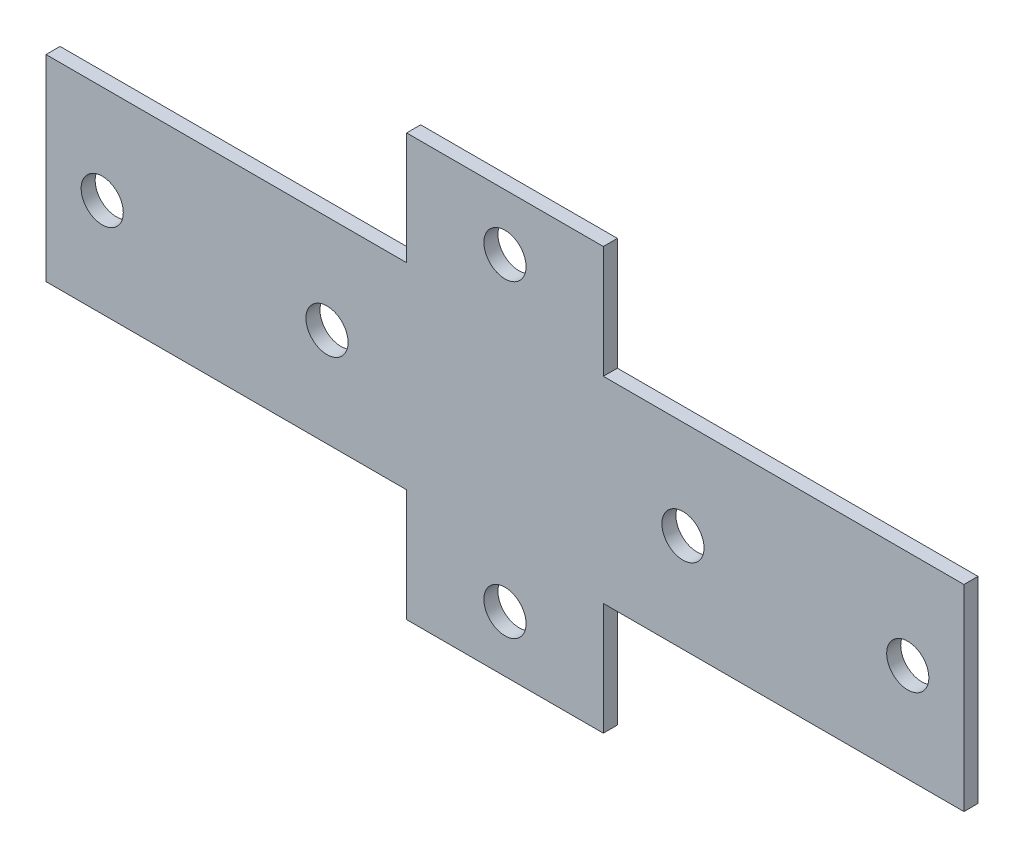
ISO-10303-21;
HEADER;
FILE_DESCRIPTION(('STEP AP214'),'2;1');
FILE_NAME('part.step','',(''),(''),'','','');
FILE_SCHEMA(('AUTOMOTIVE_DESIGN { 1 0 10303 214 1 1 1 1 }'));
ENDSEC;
DATA;
#1=APPLICATION_CONTEXT('core data for automotive mechanical design processes');
#2=APPLICATION_PROTOCOL_DEFINITION('international standard','automotive_design',2000,#1);
#3=PRODUCT_CONTEXT('',#1,'mechanical');
#4=PRODUCT('Part','Part','',(#3));
#5=PRODUCT_RELATED_PRODUCT_CATEGORY('part','',(#4));
#6=PRODUCT_DEFINITION_FORMATION('','',#4);
#7=PRODUCT_DEFINITION_CONTEXT('part definition',#1,'design');
#8=PRODUCT_DEFINITION('design','',#6,#7);
#9=PRODUCT_DEFINITION_SHAPE('','',#8);
#10=(LENGTH_UNIT() NAMED_UNIT(*) SI_UNIT(.MILLI.,.METRE.));
#11=(NAMED_UNIT(*) PLANE_ANGLE_UNIT() SI_UNIT($,.RADIAN.));
#12=(NAMED_UNIT(*) SI_UNIT($,.STERADIAN.) SOLID_ANGLE_UNIT());
#13=UNCERTAINTY_MEASURE_WITH_UNIT(LENGTH_MEASURE(1.E-05),#10,'distance_accuracy_value','');
#14=(GEOMETRIC_REPRESENTATION_CONTEXT(3) GLOBAL_UNCERTAINTY_ASSIGNED_CONTEXT((#13)) GLOBAL_UNIT_ASSIGNED_CONTEXT((#10,
#11,#12)) REPRESENTATION_CONTEXT('',''));
#15=CARTESIAN_POINT('',(0.,0.,0.));
#16=DIRECTION('',(0.,0.,1.));
#17=DIRECTION('',(1.,0.,0.));
#18=AXIS2_PLACEMENT_3D('',#15,#16,#17);
#19=CARTESIAN_POINT('',(0.,0.,3.));
#20=DIRECTION('',(0.,0.,1.));
#21=DIRECTION('',(1.,0.,0.));
#22=AXIS2_PLACEMENT_3D('',#19,#20,#21);
#23=PLANE('',#22);
#24=CARTESIAN_POINT('',(37.9999999999999,0.,3.));
#25=DIRECTION('',(0.,0.,1.));
#26=DIRECTION('',(-1.,0.,0.));
#27=AXIS2_PLACEMENT_3D('',#24,#25,#26);
#28=CIRCLE('',#27,4.5);
#29=CARTESIAN_POINT('',(33.4999999999999,0.,3.));
#30=VERTEX_POINT('',#29);
#31=EDGE_CURVE('E300',#30,#30,#28,.T.);
#32=ORIENTED_EDGE('',*,*,#31,.F.);
#33=EDGE_LOOP('',(#32));
#34=FACE_BOUND('',#33,.T.);
#35=CARTESIAN_POINT('',(-85.9999999999999,0.,3.));
#36=DIRECTION('',(0.,0.,1.));
#37=DIRECTION('',(1.,0.,0.));
#38=AXIS2_PLACEMENT_3D('',#35,#36,#37);
#39=CIRCLE('',#38,4.5);
#40=CARTESIAN_POINT('',(-81.4999999999998,0.,3.));
#41=VERTEX_POINT('',#40);
#42=EDGE_CURVE('E312',#41,#41,#39,.T.);
#43=ORIENTED_EDGE('',*,*,#42,.F.);
#44=EDGE_LOOP('',(#43));
#45=FACE_BOUND('',#44,.T.);
#46=CARTESIAN_POINT('',(0.,-33.,3.));
#47=DIRECTION('',(0.,0.,1.));
#48=DIRECTION('',(1.,0.,0.));
#49=AXIS2_PLACEMENT_3D('',#46,#47,#48);
#50=CIRCLE('',#49,4.5);
#51=CARTESIAN_POINT('',(4.5,-33.,3.));
#52=VERTEX_POINT('',#51);
#53=EDGE_CURVE('E159',#52,#52,#50,.T.);
#54=ORIENTED_EDGE('',*,*,#53,.F.);
#55=EDGE_LOOP('',(#54));
#56=FACE_BOUND('',#55,.T.);
#57=DIRECTION('',(0.,1.,0.));
#58=VECTOR('',#57,1.);
#59=CARTESIAN_POINT('',(98.0000000000001,21.,3.));
#60=LINE('',#59,#58);
#61=CARTESIAN_POINT('',(98.0000000000001,-21.,3.));
#62=VERTEX_POINT('',#61);
#63=CARTESIAN_POINT('',(98.0000000000001,21.,3.));
#64=VERTEX_POINT('',#63);
#65=EDGE_CURVE('E178',#62,#64,#60,.T.);
#66=ORIENTED_EDGE('',*,*,#65,.T.);
#67=DIRECTION('',(-1.,0.,0.));
#68=VECTOR('',#67,1.);
#69=CARTESIAN_POINT('',(21.,21.,3.));
#70=LINE('',#69,#68);
#71=CARTESIAN_POINT('',(21.,21.,3.));
#72=VERTEX_POINT('',#71);
#73=EDGE_CURVE('E106',#64,#72,#70,.T.);
#74=ORIENTED_EDGE('',*,*,#73,.T.);
#75=DIRECTION('',(0.,1.,0.));
#76=VECTOR('',#75,1.);
#77=CARTESIAN_POINT('',(21.,21.,3.));
#78=LINE('',#77,#76);
#79=CARTESIAN_POINT('',(21.,45.,3.));
#80=VERTEX_POINT('',#79);
#81=EDGE_CURVE('E205',#72,#80,#78,.T.);
#82=ORIENTED_EDGE('',*,*,#81,.T.);
#83=DIRECTION('',(-1.,0.,0.));
#84=VECTOR('',#83,1.);
#85=CARTESIAN_POINT('',(-21.,45.,3.));
#86=LINE('',#85,#84);
#87=CARTESIAN_POINT('',(-21.,45.,3.));
#88=VERTEX_POINT('',#87);
#89=EDGE_CURVE('E224',#80,#88,#86,.T.);
#90=ORIENTED_EDGE('',*,*,#89,.T.);
#91=DIRECTION('',(0.,-1.,0.));
#92=VECTOR('',#91,1.);
#93=CARTESIAN_POINT('',(-21.,21.,3.));
#94=LINE('',#93,#92);
#95=CARTESIAN_POINT('',(-21.,21.,3.));
#96=VERTEX_POINT('',#95);
#97=EDGE_CURVE('E221',#88,#96,#94,.T.);
#98=ORIENTED_EDGE('',*,*,#97,.T.);
#99=DIRECTION('',(-1.,0.,0.));
#100=VECTOR('',#99,1.);
#101=CARTESIAN_POINT('',(-97.9999999999999,21.,3.));
#102=LINE('',#101,#100);
#103=CARTESIAN_POINT('',(-97.9999999999999,21.,3.));
#104=VERTEX_POINT('',#103);
#105=EDGE_CURVE('E223',#96,#104,#102,.T.);
#106=ORIENTED_EDGE('',*,*,#105,.T.);
#107=DIRECTION('',(0.,-1.,0.));
#108=VECTOR('',#107,1.);
#109=CARTESIAN_POINT('',(-97.9999999999999,21.,3.));
#110=LINE('',#109,#108);
#111=CARTESIAN_POINT('',(-97.9999999999999,-21.,3.));
#112=VERTEX_POINT('',#111);
#113=EDGE_CURVE('E226',#104,#112,#110,.T.);
#114=ORIENTED_EDGE('',*,*,#113,.T.);
#115=DIRECTION('',(1.,0.,0.));
#116=VECTOR('',#115,1.);
#117=CARTESIAN_POINT('',(-97.9999999999999,-21.,3.));
#118=LINE('',#117,#116);
#119=CARTESIAN_POINT('',(-21.,-21.,3.));
#120=VERTEX_POINT('',#119);
#121=EDGE_CURVE('E232',#112,#120,#118,.T.);
#122=ORIENTED_EDGE('',*,*,#121,.T.);
#123=DIRECTION('',(0.,-1.,0.));
#124=VECTOR('',#123,1.);
#125=CARTESIAN_POINT('',(-21.,-45.,3.));
#126=LINE('',#125,#124);
#127=CARTESIAN_POINT('',(-21.,-45.,3.));
#128=VERTEX_POINT('',#127);
#129=EDGE_CURVE('E137',#120,#128,#126,.T.);
#130=ORIENTED_EDGE('',*,*,#129,.T.);
#131=DIRECTION('',(1.,0.,0.));
#132=VECTOR('',#131,1.);
#133=CARTESIAN_POINT('',(-21.,-45.,3.));
#134=LINE('',#133,#132);
#135=CARTESIAN_POINT('',(21.,-45.,3.));
#136=VERTEX_POINT('',#135);
#137=EDGE_CURVE('E131',#128,#136,#134,.T.);
#138=ORIENTED_EDGE('',*,*,#137,.T.);
#139=DIRECTION('',(0.,1.,0.));
#140=VECTOR('',#139,1.);
#141=CARTESIAN_POINT('',(21.,-45.,3.));
#142=LINE('',#141,#140);
#143=CARTESIAN_POINT('',(21.,-21.,3.));
#144=VERTEX_POINT('',#143);
#145=EDGE_CURVE('E135',#136,#144,#142,.T.);
#146=ORIENTED_EDGE('',*,*,#145,.T.);
#147=DIRECTION('',(1.,0.,0.));
#148=VECTOR('',#147,1.);
#149=CARTESIAN_POINT('',(21.,-21.,3.));
#150=LINE('',#149,#148);
#151=EDGE_CURVE('E51',#144,#62,#150,.T.);
#152=ORIENTED_EDGE('',*,*,#151,.T.);
#153=EDGE_LOOP('',(#66,#74,#82,#90,#98,#106,#114,#122,#130,#138,#146,#152));
#154=FACE_BOUND('',#153,.T.);
#155=CARTESIAN_POINT('',(0.,33.,3.));
#156=DIRECTION('',(0.,0.,1.));
#157=DIRECTION('',(1.,0.,0.));
#158=AXIS2_PLACEMENT_3D('',#155,#156,#157);
#159=CIRCLE('',#158,4.5);
#160=CARTESIAN_POINT('',(4.5,33.,3.));
#161=VERTEX_POINT('',#160);
#162=EDGE_CURVE('E318',#161,#161,#159,.T.);
#163=ORIENTED_EDGE('',*,*,#162,.F.);
#164=EDGE_LOOP('',(#163));
#165=FACE_BOUND('',#164,.T.);
#166=CARTESIAN_POINT('',(-37.9999999999999,0.,3.));
#167=DIRECTION('',(0.,0.,1.));
#168=DIRECTION('',(1.,0.,0.));
#169=AXIS2_PLACEMENT_3D('',#166,#167,#168);
#170=CIRCLE('',#169,4.5);
#171=CARTESIAN_POINT('',(-33.4999999999999,0.,3.));
#172=VERTEX_POINT('',#171);
#173=EDGE_CURVE('E306',#172,#172,#170,.T.);
#174=ORIENTED_EDGE('',*,*,#173,.F.);
#175=EDGE_LOOP('',(#174));
#176=FACE_BOUND('',#175,.T.);
#177=CARTESIAN_POINT('',(85.9999999999999,0.,3.));
#178=DIRECTION('',(0.,0.,1.));
#179=DIRECTION('',(-1.,0.,0.));
#180=AXIS2_PLACEMENT_3D('',#177,#178,#179);
#181=CIRCLE('',#180,4.5);
#182=CARTESIAN_POINT('',(81.4999999999998,0.,3.));
#183=VERTEX_POINT('',#182);
#184=EDGE_CURVE('E291',#183,#183,#181,.T.);
#185=ORIENTED_EDGE('',*,*,#184,.F.);
#186=EDGE_LOOP('',(#185));
#187=FACE_BOUND('',#186,.T.);
#188=ADVANCED_FACE('F34',(#34,#45,#56,#154,#165,#176,#187),#23,.T.);
#189=CARTESIAN_POINT('',(0.,0.,0.));
#190=DIRECTION('',(0.,0.,1.));
#191=DIRECTION('',(1.,0.,0.));
#192=AXIS2_PLACEMENT_3D('',#189,#190,#191);
#193=PLANE('',#192);
#194=DIRECTION('',(0.,1.,0.));
#195=VECTOR('',#194,1.);
#196=CARTESIAN_POINT('',(98.0000000000001,21.,0.));
#197=LINE('',#196,#195);
#198=CARTESIAN_POINT('',(98.0000000000001,-21.,0.));
#199=VERTEX_POINT('',#198);
#200=CARTESIAN_POINT('',(98.0000000000001,21.,0.));
#201=VERTEX_POINT('',#200);
#202=EDGE_CURVE('E155',#199,#201,#197,.T.);
#203=ORIENTED_EDGE('',*,*,#202,.F.);
#204=DIRECTION('',(1.,0.,0.));
#205=VECTOR('',#204,1.);
#206=CARTESIAN_POINT('',(21.,-21.,0.));
#207=LINE('',#206,#205);
#208=CARTESIAN_POINT('',(21.,-21.,0.));
#209=VERTEX_POINT('',#208);
#210=EDGE_CURVE('E98',#209,#199,#207,.T.);
#211=ORIENTED_EDGE('',*,*,#210,.F.);
#212=DIRECTION('',(0.,1.,0.));
#213=VECTOR('',#212,1.);
#214=CARTESIAN_POINT('',(21.,-45.,0.));
#215=LINE('',#214,#213);
#216=CARTESIAN_POINT('',(21.,-45.,0.));
#217=VERTEX_POINT('',#216);
#218=EDGE_CURVE('E92',#217,#209,#215,.T.);
#219=ORIENTED_EDGE('',*,*,#218,.F.);
#220=DIRECTION('',(1.,0.,0.));
#221=VECTOR('',#220,1.);
#222=CARTESIAN_POINT('',(-21.,-45.,0.));
#223=LINE('',#222,#221);
#224=CARTESIAN_POINT('',(-21.,-45.,0.));
#225=VERTEX_POINT('',#224);
#226=EDGE_CURVE('E145',#225,#217,#223,.T.);
#227=ORIENTED_EDGE('',*,*,#226,.F.);
#228=DIRECTION('',(0.,-1.,0.));
#229=VECTOR('',#228,1.);
#230=CARTESIAN_POINT('',(-21.,-45.,0.));
#231=LINE('',#230,#229);
#232=CARTESIAN_POINT('',(-21.,-21.,0.));
#233=VERTEX_POINT('',#232);
#234=EDGE_CURVE('E173',#233,#225,#231,.T.);
#235=ORIENTED_EDGE('',*,*,#234,.F.);
#236=DIRECTION('',(1.,0.,0.));
#237=VECTOR('',#236,1.);
#238=CARTESIAN_POINT('',(-97.9999999999999,-21.,0.));
#239=LINE('',#238,#237);
#240=CARTESIAN_POINT('',(-97.9999999999999,-21.,0.));
#241=VERTEX_POINT('',#240);
#242=EDGE_CURVE('E171',#241,#233,#239,.T.);
#243=ORIENTED_EDGE('',*,*,#242,.F.);
#244=DIRECTION('',(0.,-1.,0.));
#245=VECTOR('',#244,1.);
#246=CARTESIAN_POINT('',(-97.9999999999999,21.,0.));
#247=LINE('',#246,#245);
#248=CARTESIAN_POINT('',(-97.9999999999999,21.,0.));
#249=VERTEX_POINT('',#248);
#250=EDGE_CURVE('E169',#249,#241,#247,.T.);
#251=ORIENTED_EDGE('',*,*,#250,.F.);
#252=DIRECTION('',(-1.,0.,0.));
#253=VECTOR('',#252,1.);
#254=CARTESIAN_POINT('',(-97.9999999999999,21.,0.));
#255=LINE('',#254,#253);
#256=CARTESIAN_POINT('',(-21.,21.,0.));
#257=VERTEX_POINT('',#256);
#258=EDGE_CURVE('E167',#257,#249,#255,.T.);
#259=ORIENTED_EDGE('',*,*,#258,.F.);
#260=DIRECTION('',(0.,-1.,0.));
#261=VECTOR('',#260,1.);
#262=CARTESIAN_POINT('',(-21.,21.,0.));
#263=LINE('',#262,#261);
#264=CARTESIAN_POINT('',(-21.,45.,0.));
#265=VERTEX_POINT('',#264);
#266=EDGE_CURVE('E165',#265,#257,#263,.T.);
#267=ORIENTED_EDGE('',*,*,#266,.F.);
#268=DIRECTION('',(-1.,0.,0.));
#269=VECTOR('',#268,1.);
#270=CARTESIAN_POINT('',(-21.,45.,0.));
#271=LINE('',#270,#269);
#272=CARTESIAN_POINT('',(21.,45.,0.));
#273=VERTEX_POINT('',#272);
#274=EDGE_CURVE('E163',#273,#265,#271,.T.);
#275=ORIENTED_EDGE('',*,*,#274,.F.);
#276=DIRECTION('',(0.,1.,0.));
#277=VECTOR('',#276,1.);
#278=CARTESIAN_POINT('',(21.,21.,0.));
#279=LINE('',#278,#277);
#280=CARTESIAN_POINT('',(21.,21.,0.));
#281=VERTEX_POINT('',#280);
#282=EDGE_CURVE('E161',#281,#273,#279,.T.);
#283=ORIENTED_EDGE('',*,*,#282,.F.);
#284=DIRECTION('',(-1.,0.,0.));
#285=VECTOR('',#284,1.);
#286=CARTESIAN_POINT('',(21.,21.,0.));
#287=LINE('',#286,#285);
#288=EDGE_CURVE('E158',#201,#281,#287,.T.);
#289=ORIENTED_EDGE('',*,*,#288,.F.);
#290=EDGE_LOOP('',(#203,#211,#219,#227,#235,#243,#251,#259,#267,#275,#283,#289));
#291=FACE_BOUND('',#290,.T.);
#292=CARTESIAN_POINT('',(0.,-33.,0.));
#293=DIRECTION('',(0.,0.,1.));
#294=DIRECTION('',(1.,0.,0.));
#295=AXIS2_PLACEMENT_3D('',#292,#293,#294);
#296=CIRCLE('',#295,4.5);
#297=CARTESIAN_POINT('',(4.5,-33.,0.));
#298=VERTEX_POINT('',#297);
#299=EDGE_CURVE('E321',#298,#298,#296,.T.);
#300=ORIENTED_EDGE('',*,*,#299,.T.);
#301=EDGE_LOOP('',(#300));
#302=FACE_BOUND('',#301,.T.);
#303=CARTESIAN_POINT('',(0.,33.,0.));
#304=DIRECTION('',(0.,0.,1.));
#305=DIRECTION('',(1.,0.,0.));
#306=AXIS2_PLACEMENT_3D('',#303,#304,#305);
#307=CIRCLE('',#306,4.5);
#308=CARTESIAN_POINT('',(4.5,33.,0.));
#309=VERTEX_POINT('',#308);
#310=EDGE_CURVE('E315',#309,#309,#307,.T.);
#311=ORIENTED_EDGE('',*,*,#310,.T.);
#312=EDGE_LOOP('',(#311));
#313=FACE_BOUND('',#312,.T.);
#314=CARTESIAN_POINT('',(-85.9999999999999,0.,0.));
#315=DIRECTION('',(0.,0.,1.));
#316=DIRECTION('',(1.,0.,0.));
#317=AXIS2_PLACEMENT_3D('',#314,#315,#316);
#318=CIRCLE('',#317,4.5);
#319=CARTESIAN_POINT('',(-81.4999999999998,0.,0.));
#320=VERTEX_POINT('',#319);
#321=EDGE_CURVE('E309',#320,#320,#318,.T.);
#322=ORIENTED_EDGE('',*,*,#321,.T.);
#323=EDGE_LOOP('',(#322));
#324=FACE_BOUND('',#323,.T.);
#325=CARTESIAN_POINT('',(-37.9999999999999,0.,0.));
#326=DIRECTION('',(0.,0.,1.));
#327=DIRECTION('',(1.,0.,0.));
#328=AXIS2_PLACEMENT_3D('',#325,#326,#327);
#329=CIRCLE('',#328,4.5);
#330=CARTESIAN_POINT('',(-33.4999999999999,0.,0.));
#331=VERTEX_POINT('',#330);
#332=EDGE_CURVE('E303',#331,#331,#329,.T.);
#333=ORIENTED_EDGE('',*,*,#332,.T.);
#334=EDGE_LOOP('',(#333));
#335=FACE_BOUND('',#334,.T.);
#336=CARTESIAN_POINT('',(37.9999999999999,0.,0.));
#337=DIRECTION('',(0.,0.,1.));
#338=DIRECTION('',(-1.,0.,0.));
#339=AXIS2_PLACEMENT_3D('',#336,#337,#338);
#340=CIRCLE('',#339,4.5);
#341=CARTESIAN_POINT('',(33.4999999999999,0.,0.));
#342=VERTEX_POINT('',#341);
#343=EDGE_CURVE('E297',#342,#342,#340,.T.);
#344=ORIENTED_EDGE('',*,*,#343,.T.);
#345=EDGE_LOOP('',(#344));
#346=FACE_BOUND('',#345,.T.);
#347=CARTESIAN_POINT('',(85.9999999999999,0.,0.));
#348=DIRECTION('',(0.,0.,1.));
#349=DIRECTION('',(-1.,0.,0.));
#350=AXIS2_PLACEMENT_3D('',#347,#348,#349);
#351=CIRCLE('',#350,4.5);
#352=CARTESIAN_POINT('',(81.4999999999998,0.,0.));
#353=VERTEX_POINT('',#352);
#354=EDGE_CURVE('E294',#353,#353,#351,.T.);
#355=ORIENTED_EDGE('',*,*,#354,.T.);
#356=EDGE_LOOP('',(#355));
#357=FACE_BOUND('',#356,.T.);
#358=ADVANCED_FACE('F209',(#291,#302,#313,#324,#335,#346,#357),#193,.F.);
#359=CARTESIAN_POINT('',(98.0000000000001,21.,3.));
#360=DIRECTION('',(-1.,0.,0.));
#361=DIRECTION('',(0.,0.,1.));
#362=AXIS2_PLACEMENT_3D('',#359,#360,#361);
#363=PLANE('',#362);
#364=ORIENTED_EDGE('',*,*,#202,.T.);
#365=DIRECTION('',(0.,0.,-1.));
#366=VECTOR('',#365,1.);
#367=CARTESIAN_POINT('',(98.0000000000001,21.,3.));
#368=LINE('',#367,#366);
#369=EDGE_CURVE('E11',#64,#201,#368,.T.);
#370=ORIENTED_EDGE('',*,*,#369,.F.);
#371=ORIENTED_EDGE('',*,*,#65,.F.);
#372=DIRECTION('',(0.,0.,-1.));
#373=VECTOR('',#372,1.);
#374=CARTESIAN_POINT('',(98.0000000000001,-21.,3.));
#375=LINE('',#374,#373);
#376=EDGE_CURVE('E151',#62,#199,#375,.T.);
#377=ORIENTED_EDGE('',*,*,#376,.T.);
#378=EDGE_LOOP('',(#364,#370,#371,#377));
#379=FACE_BOUND('',#378,.T.);
#380=ADVANCED_FACE('F36',(#379),#363,.F.);
#381=CARTESIAN_POINT('',(21.,21.,3.));
#382=DIRECTION('',(0.,-1.,0.));
#383=DIRECTION('',(1.,0.,0.));
#384=AXIS2_PLACEMENT_3D('',#381,#382,#383);
#385=PLANE('',#384);
#386=ORIENTED_EDGE('',*,*,#288,.T.);
#387=DIRECTION('',(0.,0.,-1.));
#388=VECTOR('',#387,1.);
#389=CARTESIAN_POINT('',(21.,21.,3.));
#390=LINE('',#389,#388);
#391=EDGE_CURVE('E43',#72,#281,#390,.T.);
#392=ORIENTED_EDGE('',*,*,#391,.F.);
#393=ORIENTED_EDGE('',*,*,#73,.F.);
#394=ORIENTED_EDGE('',*,*,#369,.T.);
#395=EDGE_LOOP('',(#386,#392,#393,#394));
#396=FACE_BOUND('',#395,.T.);
#397=ADVANCED_FACE('F449',(#396),#385,.F.);
#398=CARTESIAN_POINT('',(21.,21.,3.));
#399=DIRECTION('',(-1.,0.,0.));
#400=DIRECTION('',(0.,-1.,0.));
#401=AXIS2_PLACEMENT_3D('',#398,#399,#400);
#402=PLANE('',#401);
#403=ORIENTED_EDGE('',*,*,#282,.T.);
#404=DIRECTION('',(0.,0.,-1.));
#405=VECTOR('',#404,1.);
#406=CARTESIAN_POINT('',(21.,45.,3.));
#407=LINE('',#406,#405);
#408=EDGE_CURVE('E197',#80,#273,#407,.T.);
#409=ORIENTED_EDGE('',*,*,#408,.F.);
#410=ORIENTED_EDGE('',*,*,#81,.F.);
#411=ORIENTED_EDGE('',*,*,#391,.T.);
#412=EDGE_LOOP('',(#403,#409,#410,#411));
#413=FACE_BOUND('',#412,.T.);
#414=ADVANCED_FACE('F203',(#413),#402,.F.);
#415=CARTESIAN_POINT('',(-21.,45.,3.));
#416=DIRECTION('',(0.,-1.,0.));
#417=DIRECTION('',(0.,0.,-1.));
#418=AXIS2_PLACEMENT_3D('',#415,#416,#417);
#419=PLANE('',#418);
#420=ORIENTED_EDGE('',*,*,#274,.T.);
#421=DIRECTION('',(0.,0.,-1.));
#422=VECTOR('',#421,1.);
#423=CARTESIAN_POINT('',(-21.,45.,3.));
#424=LINE('',#423,#422);
#425=EDGE_CURVE('E194',#88,#265,#424,.T.);
#426=ORIENTED_EDGE('',*,*,#425,.F.);
#427=ORIENTED_EDGE('',*,*,#89,.F.);
#428=ORIENTED_EDGE('',*,*,#408,.T.);
#429=EDGE_LOOP('',(#420,#426,#427,#428));
#430=FACE_BOUND('',#429,.T.);
#431=ADVANCED_FACE('F215',(#430),#419,.F.);
#432=CARTESIAN_POINT('',(-21.,21.,3.));
#433=DIRECTION('',(1.,0.,0.));
#434=DIRECTION('',(0.,1.,0.));
#435=AXIS2_PLACEMENT_3D('',#432,#433,#434);
#436=PLANE('',#435);
#437=ORIENTED_EDGE('',*,*,#266,.T.);
#438=DIRECTION('',(0.,0.,-1.));
#439=VECTOR('',#438,1.);
#440=CARTESIAN_POINT('',(-21.,21.,3.));
#441=LINE('',#440,#439);
#442=EDGE_CURVE('E191',#96,#257,#441,.T.);
#443=ORIENTED_EDGE('',*,*,#442,.F.);
#444=ORIENTED_EDGE('',*,*,#97,.F.);
#445=ORIENTED_EDGE('',*,*,#425,.T.);
#446=EDGE_LOOP('',(#437,#443,#444,#445));
#447=FACE_BOUND('',#446,.T.);
#448=ADVANCED_FACE('F219',(#447),#436,.F.);
#449=CARTESIAN_POINT('',(-97.9999999999999,21.,3.));
#450=DIRECTION('',(0.,-1.,0.));
#451=DIRECTION('',(1.,0.,0.));
#452=AXIS2_PLACEMENT_3D('',#449,#450,#451);
#453=PLANE('',#452);
#454=ORIENTED_EDGE('',*,*,#258,.T.);
#455=DIRECTION('',(0.,0.,-1.));
#456=VECTOR('',#455,1.);
#457=CARTESIAN_POINT('',(-97.9999999999999,21.,3.));
#458=LINE('',#457,#456);
#459=EDGE_CURVE('E188',#104,#249,#458,.T.);
#460=ORIENTED_EDGE('',*,*,#459,.F.);
#461=ORIENTED_EDGE('',*,*,#105,.F.);
#462=ORIENTED_EDGE('',*,*,#442,.T.);
#463=EDGE_LOOP('',(#454,#460,#461,#462));
#464=FACE_BOUND('',#463,.T.);
#465=ADVANCED_FACE('F414',(#464),#453,.F.);
#466=CARTESIAN_POINT('',(-97.9999999999999,21.,3.));
#467=DIRECTION('',(1.,0.,0.));
#468=DIRECTION('',(0.,0.,-1.));
#469=AXIS2_PLACEMENT_3D('',#466,#467,#468);
#470=PLANE('',#469);
#471=ORIENTED_EDGE('',*,*,#250,.T.);
#472=DIRECTION('',(0.,0.,-1.));
#473=VECTOR('',#472,1.);
#474=CARTESIAN_POINT('',(-97.9999999999999,-21.,3.));
#475=LINE('',#474,#473);
#476=EDGE_CURVE('E185',#112,#241,#475,.T.);
#477=ORIENTED_EDGE('',*,*,#476,.F.);
#478=ORIENTED_EDGE('',*,*,#113,.F.);
#479=ORIENTED_EDGE('',*,*,#459,.T.);
#480=EDGE_LOOP('',(#471,#477,#478,#479));
#481=FACE_BOUND('',#480,.T.);
#482=ADVANCED_FACE('F405',(#481),#470,.F.);
#483=CARTESIAN_POINT('',(-97.9999999999999,-21.,3.));
#484=DIRECTION('',(0.,1.,0.));
#485=DIRECTION('',(0.,0.,1.));
#486=AXIS2_PLACEMENT_3D('',#483,#484,#485);
#487=PLANE('',#486);
#488=ORIENTED_EDGE('',*,*,#242,.T.);
#489=DIRECTION('',(0.,0.,-1.));
#490=VECTOR('',#489,1.);
#491=CARTESIAN_POINT('',(-21.,-21.,3.));
#492=LINE('',#491,#490);
#493=EDGE_CURVE('E182',#120,#233,#492,.T.);
#494=ORIENTED_EDGE('',*,*,#493,.F.);
#495=ORIENTED_EDGE('',*,*,#121,.F.);
#496=ORIENTED_EDGE('',*,*,#476,.T.);
#497=EDGE_LOOP('',(#488,#494,#495,#496));
#498=FACE_BOUND('',#497,.T.);
#499=ADVANCED_FACE('F238',(#498),#487,.F.);
#500=CARTESIAN_POINT('',(-21.,-45.,3.));
#501=DIRECTION('',(1.,0.,0.));
#502=DIRECTION('',(0.,1.,0.));
#503=AXIS2_PLACEMENT_3D('',#500,#501,#502);
#504=PLANE('',#503);
#505=ORIENTED_EDGE('',*,*,#234,.T.);
#506=DIRECTION('',(0.,0.,-1.));
#507=VECTOR('',#506,1.);
#508=CARTESIAN_POINT('',(-21.,-45.,3.));
#509=LINE('',#508,#507);
#510=EDGE_CURVE('E146',#128,#225,#509,.T.);
#511=ORIENTED_EDGE('',*,*,#510,.F.);
#512=ORIENTED_EDGE('',*,*,#129,.F.);
#513=ORIENTED_EDGE('',*,*,#493,.T.);
#514=EDGE_LOOP('',(#505,#511,#512,#513));
#515=FACE_BOUND('',#514,.T.);
#516=ADVANCED_FACE('F242',(#515),#504,.F.);
#517=CARTESIAN_POINT('',(-21.,-45.,3.));
#518=DIRECTION('',(0.,1.,0.));
#519=DIRECTION('',(0.,0.,1.));
#520=AXIS2_PLACEMENT_3D('',#517,#518,#519);
#521=PLANE('',#520);
#522=ORIENTED_EDGE('',*,*,#226,.T.);
#523=DIRECTION('',(0.,0.,-1.));
#524=VECTOR('',#523,1.);
#525=CARTESIAN_POINT('',(21.,-45.,3.));
#526=LINE('',#525,#524);
#527=EDGE_CURVE('E142',#136,#217,#526,.T.);
#528=ORIENTED_EDGE('',*,*,#527,.F.);
#529=ORIENTED_EDGE('',*,*,#137,.F.);
#530=ORIENTED_EDGE('',*,*,#510,.T.);
#531=EDGE_LOOP('',(#522,#528,#529,#530));
#532=FACE_BOUND('',#531,.T.);
#533=ADVANCED_FACE('F143',(#532),#521,.F.);
#534=CARTESIAN_POINT('',(21.,-45.,3.));
#535=DIRECTION('',(-1.,0.,0.));
#536=DIRECTION('',(0.,-1.,0.));
#537=AXIS2_PLACEMENT_3D('',#534,#535,#536);
#538=PLANE('',#537);
#539=ORIENTED_EDGE('',*,*,#218,.T.);
#540=DIRECTION('',(0.,0.,-1.));
#541=VECTOR('',#540,1.);
#542=CARTESIAN_POINT('',(21.,-21.,3.));
#543=LINE('',#542,#541);
#544=EDGE_CURVE('E147',#144,#209,#543,.T.);
#545=ORIENTED_EDGE('',*,*,#544,.F.);
#546=ORIENTED_EDGE('',*,*,#145,.F.);
#547=ORIENTED_EDGE('',*,*,#527,.T.);
#548=EDGE_LOOP('',(#539,#545,#546,#547));
#549=FACE_BOUND('',#548,.T.);
#550=ADVANCED_FACE('F149',(#549),#538,.F.);
#551=CARTESIAN_POINT('',(21.,-21.,3.));
#552=DIRECTION('',(0.,1.,0.));
#553=DIRECTION('',(-1.,0.,0.));
#554=AXIS2_PLACEMENT_3D('',#551,#552,#553);
#555=PLANE('',#554);
#556=ORIENTED_EDGE('',*,*,#210,.T.);
#557=ORIENTED_EDGE('',*,*,#376,.F.);
#558=ORIENTED_EDGE('',*,*,#151,.F.);
#559=ORIENTED_EDGE('',*,*,#544,.T.);
#560=EDGE_LOOP('',(#556,#557,#558,#559));
#561=FACE_BOUND('',#560,.T.);
#562=ADVANCED_FACE('F246',(#561),#555,.F.);
#563=CARTESIAN_POINT('',(0.,-33.,3.));
#564=DIRECTION('',(0.,0.,-1.));
#565=DIRECTION('',(-1.,0.,0.));
#566=AXIS2_PLACEMENT_3D('',#563,#564,#565);
#567=CYLINDRICAL_SURFACE('',#566,4.5);
#568=ORIENTED_EDGE('',*,*,#53,.T.);
#569=EDGE_LOOP('',(#568));
#570=FACE_BOUND('',#569,.T.);
#571=ORIENTED_EDGE('',*,*,#299,.F.);
#572=EDGE_LOOP('',(#571));
#573=FACE_BOUND('',#572,.T.);
#574=ADVANCED_FACE('F248',(#570,#573),#567,.F.);
#575=CARTESIAN_POINT('',(0.,33.,3.));
#576=DIRECTION('',(0.,0.,-1.));
#577=DIRECTION('',(-1.,0.,0.));
#578=AXIS2_PLACEMENT_3D('',#575,#576,#577);
#579=CYLINDRICAL_SURFACE('',#578,4.5);
#580=ORIENTED_EDGE('',*,*,#162,.T.);
#581=EDGE_LOOP('',(#580));
#582=FACE_BOUND('',#581,.T.);
#583=ORIENTED_EDGE('',*,*,#310,.F.);
#584=EDGE_LOOP('',(#583));
#585=FACE_BOUND('',#584,.T.);
#586=ADVANCED_FACE('F254',(#582,#585),#579,.F.);
#587=CARTESIAN_POINT('',(-85.9999999999999,0.,3.));
#588=DIRECTION('',(0.,0.,-1.));
#589=DIRECTION('',(-1.,0.,0.));
#590=AXIS2_PLACEMENT_3D('',#587,#588,#589);
#591=CYLINDRICAL_SURFACE('',#590,4.5);
#592=ORIENTED_EDGE('',*,*,#42,.T.);
#593=EDGE_LOOP('',(#592));
#594=FACE_BOUND('',#593,.T.);
#595=ORIENTED_EDGE('',*,*,#321,.F.);
#596=EDGE_LOOP('',(#595));
#597=FACE_BOUND('',#596,.T.);
#598=ADVANCED_FACE('F270',(#594,#597),#591,.F.);
#599=CARTESIAN_POINT('',(-37.9999999999999,0.,3.));
#600=DIRECTION('',(0.,0.,-1.));
#601=DIRECTION('',(-1.,0.,0.));
#602=AXIS2_PLACEMENT_3D('',#599,#600,#601);
#603=CYLINDRICAL_SURFACE('',#602,4.5);
#604=ORIENTED_EDGE('',*,*,#173,.T.);
#605=EDGE_LOOP('',(#604));
#606=FACE_BOUND('',#605,.T.);
#607=ORIENTED_EDGE('',*,*,#332,.F.);
#608=EDGE_LOOP('',(#607));
#609=FACE_BOUND('',#608,.T.);
#610=ADVANCED_FACE('F274',(#606,#609),#603,.F.);
#611=CARTESIAN_POINT('',(37.9999999999999,0.,3.));
#612=DIRECTION('',(0.,0.,-1.));
#613=DIRECTION('',(-1.,0.,0.));
#614=AXIS2_PLACEMENT_3D('',#611,#612,#613);
#615=CYLINDRICAL_SURFACE('',#614,4.5);
#616=ORIENTED_EDGE('',*,*,#31,.T.);
#617=EDGE_LOOP('',(#616));
#618=FACE_BOUND('',#617,.T.);
#619=ORIENTED_EDGE('',*,*,#343,.F.);
#620=EDGE_LOOP('',(#619));
#621=FACE_BOUND('',#620,.T.);
#622=ADVANCED_FACE('F278',(#618,#621),#615,.F.);
#623=CARTESIAN_POINT('',(85.9999999999999,0.,3.));
#624=DIRECTION('',(0.,0.,-1.));
#625=DIRECTION('',(-1.,0.,0.));
#626=AXIS2_PLACEMENT_3D('',#623,#624,#625);
#627=CYLINDRICAL_SURFACE('',#626,4.5);
#628=ORIENTED_EDGE('',*,*,#184,.T.);
#629=EDGE_LOOP('',(#628));
#630=FACE_BOUND('',#629,.T.);
#631=ORIENTED_EDGE('',*,*,#354,.F.);
#632=EDGE_LOOP('',(#631));
#633=FACE_BOUND('',#632,.T.);
#634=ADVANCED_FACE('F282',(#630,#633),#627,.F.);
#635=CLOSED_SHELL('',(#188,#358,#380,#397,#414,#431,#448,#465,#482,#499,#516,#533,#550,#562,
#574,#586,#598,#610,#622,#634));
#636=MANIFOLD_SOLID_BREP('B2',#635);
#637=ADVANCED_BREP_SHAPE_REPRESENTATION('',(#18,#636),#14);
#638=SHAPE_DEFINITION_REPRESENTATION(#9,#637);
ENDSEC;
END-ISO-10303-21;
